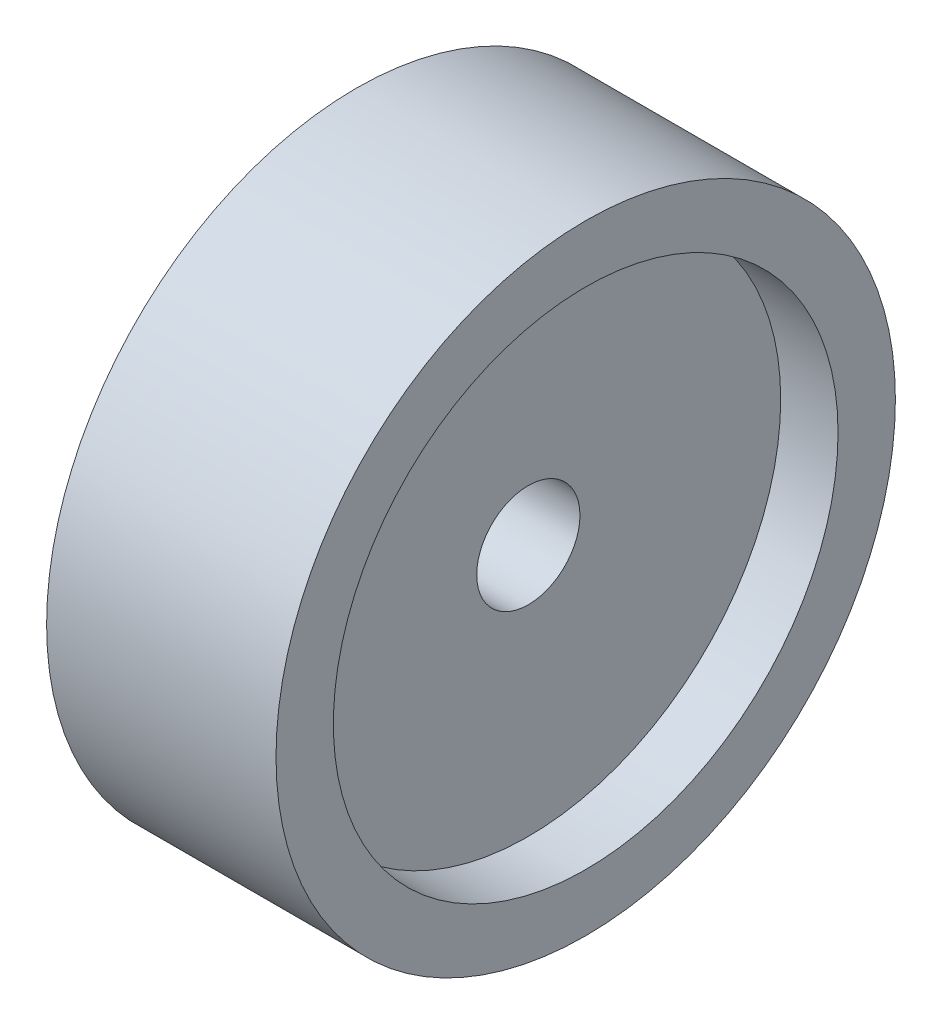
ISO-10303-21;
HEADER;
FILE_DESCRIPTION(('STEP AP214'),'2;1');
FILE_NAME('part.step','',(''),(''),'','','');
FILE_SCHEMA(('AUTOMOTIVE_DESIGN { 1 0 10303 214 1 1 1 1 }'));
ENDSEC;
DATA;
#1=APPLICATION_CONTEXT('core data for automotive mechanical design processes');
#2=APPLICATION_PROTOCOL_DEFINITION('international standard','automotive_design',2000,#1);
#3=PRODUCT_CONTEXT('',#1,'mechanical');
#4=PRODUCT('Part','Part','',(#3));
#5=PRODUCT_RELATED_PRODUCT_CATEGORY('part','',(#4));
#6=PRODUCT_DEFINITION_FORMATION('','',#4);
#7=PRODUCT_DEFINITION_CONTEXT('part definition',#1,'design');
#8=PRODUCT_DEFINITION('design','',#6,#7);
#9=PRODUCT_DEFINITION_SHAPE('','',#8);
#10=(LENGTH_UNIT() NAMED_UNIT(*) SI_UNIT(.MILLI.,.METRE.));
#11=(NAMED_UNIT(*) PLANE_ANGLE_UNIT() SI_UNIT($,.RADIAN.));
#12=(NAMED_UNIT(*) SI_UNIT($,.STERADIAN.) SOLID_ANGLE_UNIT());
#13=UNCERTAINTY_MEASURE_WITH_UNIT(LENGTH_MEASURE(1.E-05),#10,'distance_accuracy_value','');
#14=(GEOMETRIC_REPRESENTATION_CONTEXT(3) GLOBAL_UNCERTAINTY_ASSIGNED_CONTEXT((#13)) GLOBAL_UNIT_ASSIGNED_CONTEXT((#10,
#11,#12)) REPRESENTATION_CONTEXT('',''));
#15=CARTESIAN_POINT('',(0.,0.,0.));
#16=DIRECTION('',(0.,0.,1.));
#17=DIRECTION('',(1.,0.,0.));
#18=AXIS2_PLACEMENT_3D('',#15,#16,#17);
#19=CARTESIAN_POINT('',(20.,0.,0.));
#20=DIRECTION('',(-1.,0.,0.));
#21=DIRECTION('',(0.,0.,1.));
#22=AXIS2_PLACEMENT_3D('',#19,#20,#21);
#23=CYLINDRICAL_SURFACE('',#22,4.5);
#24=CARTESIAN_POINT('',(3.,0.,0.));
#25=DIRECTION('',(-1.,0.,0.));
#26=DIRECTION('',(0.,0.,1.));
#27=AXIS2_PLACEMENT_3D('',#24,#25,#26);
#28=CIRCLE('',#27,4.5);
#29=CARTESIAN_POINT('',(3.,0.,4.5));
#30=VERTEX_POINT('',#29);
#31=EDGE_CURVE('E43',#30,#30,#28,.T.);
#32=ORIENTED_EDGE('',*,*,#31,.T.);
#33=EDGE_LOOP('',(#32));
#34=FACE_BOUND('',#33,.T.);
#35=CARTESIAN_POINT('',(15.,0.,0.));
#36=DIRECTION('',(1.,0.,0.));
#37=DIRECTION('',(0.,0.,-1.));
#38=AXIS2_PLACEMENT_3D('',#35,#36,#37);
#39=CIRCLE('',#38,4.5);
#40=CARTESIAN_POINT('',(15.,0.,-4.5));
#41=VERTEX_POINT('',#40);
#42=EDGE_CURVE('E34',#41,#41,#39,.T.);
#43=ORIENTED_EDGE('',*,*,#42,.T.);
#44=EDGE_LOOP('',(#43));
#45=FACE_BOUND('',#44,.T.);
#46=ADVANCED_FACE('F30',(#34,#45),#23,.F.);
#47=CARTESIAN_POINT('',(20.,0.,0.));
#48=DIRECTION('',(1.,0.,0.));
#49=DIRECTION('',(0.,0.,-1.));
#50=AXIS2_PLACEMENT_3D('',#47,#48,#49);
#51=PLANE('',#50);
#52=CARTESIAN_POINT('',(20.,0.,0.));
#53=DIRECTION('',(1.,0.,0.));
#54=DIRECTION('',(0.,0.,-1.));
#55=AXIS2_PLACEMENT_3D('',#52,#53,#54);
#56=CIRCLE('',#55,22.);
#57=CARTESIAN_POINT('',(20.,0.,-22.));
#58=VERTEX_POINT('',#57);
#59=EDGE_CURVE('E60',#58,#58,#56,.T.);
#60=ORIENTED_EDGE('',*,*,#59,.F.);
#61=EDGE_LOOP('',(#60));
#62=FACE_BOUND('',#61,.T.);
#63=CARTESIAN_POINT('',(20.,0.,0.));
#64=DIRECTION('',(1.,0.,0.));
#65=DIRECTION('',(0.,0.,-1.));
#66=AXIS2_PLACEMENT_3D('',#63,#64,#65);
#67=CIRCLE('',#66,27.);
#68=CARTESIAN_POINT('',(20.,0.,-27.));
#69=VERTEX_POINT('',#68);
#70=EDGE_CURVE('E10',#69,#69,#67,.T.);
#71=ORIENTED_EDGE('',*,*,#70,.T.);
#72=EDGE_LOOP('',(#71));
#73=FACE_BOUND('',#72,.T.);
#74=ADVANCED_FACE('F66',(#62,#73),#51,.T.);
#75=CARTESIAN_POINT('',(0.,0.,0.));
#76=DIRECTION('',(1.,0.,0.));
#77=DIRECTION('',(0.,0.,-1.));
#78=AXIS2_PLACEMENT_3D('',#75,#76,#77);
#79=PLANE('',#78);
#80=CARTESIAN_POINT('',(0.,0.,0.));
#81=DIRECTION('',(-1.,0.,0.));
#82=DIRECTION('',(0.,0.,1.));
#83=AXIS2_PLACEMENT_3D('',#80,#81,#82);
#84=CIRCLE('',#83,22.);
#85=CARTESIAN_POINT('',(0.,0.,22.));
#86=VERTEX_POINT('',#85);
#87=EDGE_CURVE('E51',#86,#86,#84,.T.);
#88=ORIENTED_EDGE('',*,*,#87,.F.);
#89=EDGE_LOOP('',(#88));
#90=FACE_BOUND('',#89,.T.);
#91=CARTESIAN_POINT('',(0.,0.,0.));
#92=DIRECTION('',(1.,0.,0.));
#93=DIRECTION('',(0.,0.,-1.));
#94=AXIS2_PLACEMENT_3D('',#91,#92,#93);
#95=CIRCLE('',#94,27.);
#96=CARTESIAN_POINT('',(0.,0.,-27.));
#97=VERTEX_POINT('',#96);
#98=EDGE_CURVE('E38',#97,#97,#95,.T.);
#99=ORIENTED_EDGE('',*,*,#98,.F.);
#100=EDGE_LOOP('',(#99));
#101=FACE_BOUND('',#100,.T.);
#102=ADVANCED_FACE('F68',(#90,#101),#79,.F.);
#103=CARTESIAN_POINT('',(20.,0.,0.));
#104=DIRECTION('',(-1.,0.,0.));
#105=DIRECTION('',(0.,0.,1.));
#106=AXIS2_PLACEMENT_3D('',#103,#104,#105);
#107=CYLINDRICAL_SURFACE('',#106,27.);
#108=ORIENTED_EDGE('',*,*,#70,.F.);
#109=EDGE_LOOP('',(#108));
#110=FACE_BOUND('',#109,.T.);
#111=ORIENTED_EDGE('',*,*,#98,.T.);
#112=EDGE_LOOP('',(#111));
#113=FACE_BOUND('',#112,.T.);
#114=ADVANCED_FACE('F32',(#110,#113),#107,.T.);
#115=CARTESIAN_POINT('',(3.,0.,0.));
#116=DIRECTION('',(-1.,0.,0.));
#117=DIRECTION('',(0.,0.,1.));
#118=AXIS2_PLACEMENT_3D('',#115,#116,#117);
#119=CYLINDRICAL_SURFACE('',#118,22.);
#120=CARTESIAN_POINT('',(3.,0.,0.));
#121=DIRECTION('',(-1.,0.,0.));
#122=DIRECTION('',(0.,0.,1.));
#123=AXIS2_PLACEMENT_3D('',#120,#121,#122);
#124=CIRCLE('',#123,22.);
#125=CARTESIAN_POINT('',(3.,0.,22.));
#126=VERTEX_POINT('',#125);
#127=EDGE_CURVE('E47',#126,#126,#124,.T.);
#128=ORIENTED_EDGE('',*,*,#127,.F.);
#129=EDGE_LOOP('',(#128));
#130=FACE_BOUND('',#129,.T.);
#131=ORIENTED_EDGE('',*,*,#87,.T.);
#132=EDGE_LOOP('',(#131));
#133=FACE_BOUND('',#132,.T.);
#134=ADVANCED_FACE('F77',(#130,#133),#119,.F.);
#135=CARTESIAN_POINT('',(3.,0.,0.));
#136=DIRECTION('',(-1.,0.,0.));
#137=DIRECTION('',(0.,0.,1.));
#138=AXIS2_PLACEMENT_3D('',#135,#136,#137);
#139=PLANE('',#138);
#140=ORIENTED_EDGE('',*,*,#31,.F.);
#141=EDGE_LOOP('',(#140));
#142=FACE_BOUND('',#141,.T.);
#143=ORIENTED_EDGE('',*,*,#127,.T.);
#144=EDGE_LOOP('',(#143));
#145=FACE_BOUND('',#144,.T.);
#146=ADVANCED_FACE('F80',(#142,#145),#139,.T.);
#147=CARTESIAN_POINT('',(15.,0.,0.));
#148=DIRECTION('',(1.,0.,0.));
#149=DIRECTION('',(0.,0.,-1.));
#150=AXIS2_PLACEMENT_3D('',#147,#148,#149);
#151=CYLINDRICAL_SURFACE('',#150,22.);
#152=CARTESIAN_POINT('',(15.,0.,0.));
#153=DIRECTION('',(1.,0.,0.));
#154=DIRECTION('',(0.,0.,-1.));
#155=AXIS2_PLACEMENT_3D('',#152,#153,#154);
#156=CIRCLE('',#155,22.);
#157=CARTESIAN_POINT('',(15.,0.,-22.));
#158=VERTEX_POINT('',#157);
#159=EDGE_CURVE('E57',#158,#158,#156,.T.);
#160=ORIENTED_EDGE('',*,*,#159,.F.);
#161=EDGE_LOOP('',(#160));
#162=FACE_BOUND('',#161,.T.);
#163=ORIENTED_EDGE('',*,*,#59,.T.);
#164=EDGE_LOOP('',(#163));
#165=FACE_BOUND('',#164,.T.);
#166=ADVANCED_FACE('F64',(#162,#165),#151,.F.);
#167=CARTESIAN_POINT('',(15.,0.,0.));
#168=DIRECTION('',(1.,0.,0.));
#169=DIRECTION('',(0.,0.,-1.));
#170=AXIS2_PLACEMENT_3D('',#167,#168,#169);
#171=PLANE('',#170);
#172=ORIENTED_EDGE('',*,*,#42,.F.);
#173=EDGE_LOOP('',(#172));
#174=FACE_BOUND('',#173,.T.);
#175=ORIENTED_EDGE('',*,*,#159,.T.);
#176=EDGE_LOOP('',(#175));
#177=FACE_BOUND('',#176,.T.);
#178=ADVANCED_FACE('F87',(#174,#177),#171,.T.);
#179=CLOSED_SHELL('',(#46,#74,#102,#114,#134,#146,#166,#178));
#180=MANIFOLD_SOLID_BREP('B2',#179);
#181=ADVANCED_BREP_SHAPE_REPRESENTATION('',(#18,#180),#14);
#182=SHAPE_DEFINITION_REPRESENTATION(#9,#181);
ENDSEC;
END-ISO-10303-21;
